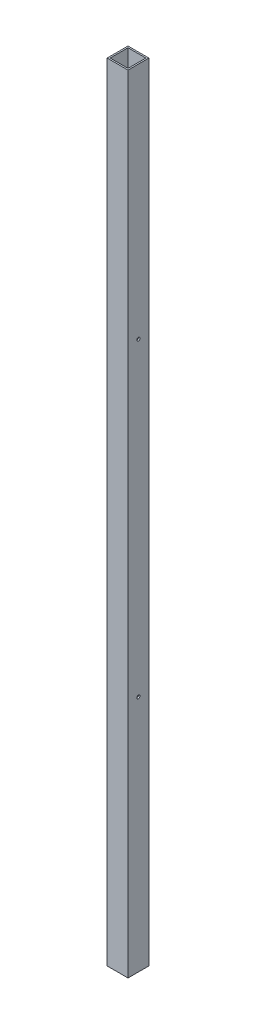
ISO-10303-21;
HEADER;
FILE_DESCRIPTION(('STEP AP214'),'2;1');
FILE_NAME('part.step','',(''),(''),'','','');
FILE_SCHEMA(('AUTOMOTIVE_DESIGN { 1 0 10303 214 1 1 1 1 }'));
ENDSEC;
DATA;
#1=APPLICATION_CONTEXT('core data for automotive mechanical design processes');
#2=APPLICATION_PROTOCOL_DEFINITION('international standard','automotive_design',2000,#1);
#3=PRODUCT_CONTEXT('',#1,'mechanical');
#4=PRODUCT('Part','Part','',(#3));
#5=PRODUCT_RELATED_PRODUCT_CATEGORY('part','',(#4));
#6=PRODUCT_DEFINITION_FORMATION('','',#4);
#7=PRODUCT_DEFINITION_CONTEXT('part definition',#1,'design');
#8=PRODUCT_DEFINITION('design','',#6,#7);
#9=PRODUCT_DEFINITION_SHAPE('','',#8);
#10=(LENGTH_UNIT() NAMED_UNIT(*) SI_UNIT(.MILLI.,.METRE.));
#11=(NAMED_UNIT(*) PLANE_ANGLE_UNIT() SI_UNIT($,.RADIAN.));
#12=(NAMED_UNIT(*) SI_UNIT($,.STERADIAN.) SOLID_ANGLE_UNIT());
#13=UNCERTAINTY_MEASURE_WITH_UNIT(LENGTH_MEASURE(1.E-05),#10,'distance_accuracy_value','');
#14=(GEOMETRIC_REPRESENTATION_CONTEXT(3) GLOBAL_UNCERTAINTY_ASSIGNED_CONTEXT((#13)) GLOBAL_UNIT_ASSIGNED_CONTEXT((#10,
#11,#12)) REPRESENTATION_CONTEXT('',''));
#15=CARTESIAN_POINT('',(0.,0.,0.));
#16=DIRECTION('',(0.,0.,1.));
#17=DIRECTION('',(1.,0.,0.));
#18=AXIS2_PLACEMENT_3D('',#15,#16,#17);
#19=CARTESIAN_POINT('',(1479.08154032126,-1168.4,22.225));
#20=DIRECTION('',(1.,0.,0.));
#21=DIRECTION('',(0.,0.,-1.));
#22=AXIS2_PLACEMENT_3D('',#19,#20,#21);
#23=CYLINDRICAL_SURFACE('',#22,3.3782);
#24=CARTESIAN_POINT('',(-155.061557817459,-1168.4,22.225));
#25=DIRECTION('',(1.,0.,0.));
#26=DIRECTION('',(0.,0.,-1.));
#27=AXIS2_PLACEMENT_3D('',#24,#25,#26);
#28=CIRCLE('',#27,3.3782);
#29=CARTESIAN_POINT('',(-155.061557817459,-1168.4,18.8468));
#30=VERTEX_POINT('',#29);
#31=EDGE_CURVE('E126',#30,#30,#28,.T.);
#32=ORIENTED_EDGE('',*,*,#31,.T.);
#33=EDGE_LOOP('',(#32));
#34=FACE_BOUND('',#33,.T.);
#35=CARTESIAN_POINT('',(-158.236557817459,-1168.4,22.225));
#36=DIRECTION('',(1.,0.,0.));
#37=DIRECTION('',(0.,0.,-1.));
#38=AXIS2_PLACEMENT_3D('',#35,#36,#37);
#39=CIRCLE('',#38,3.3782);
#40=CARTESIAN_POINT('',(-158.236557817459,-1168.4,18.8468));
#41=VERTEX_POINT('',#40);
#42=EDGE_CURVE('E17',#41,#41,#39,.T.);
#43=ORIENTED_EDGE('',*,*,#42,.F.);
#44=EDGE_LOOP('',(#43));
#45=FACE_BOUND('',#44,.T.);
#46=ADVANCED_FACE('F14',(#34,#45),#23,.F.);
#47=CARTESIAN_POINT('',(1479.08154032126,-508.,22.225));
#48=DIRECTION('',(1.,0.,0.));
#49=DIRECTION('',(0.,0.,-1.));
#50=AXIS2_PLACEMENT_3D('',#47,#48,#49);
#51=CYLINDRICAL_SURFACE('',#50,3.3782);
#52=CARTESIAN_POINT('',(-155.061557817459,-508.,22.225));
#53=DIRECTION('',(1.,0.,0.));
#54=DIRECTION('',(0.,0.,-1.));
#55=AXIS2_PLACEMENT_3D('',#52,#53,#54);
#56=CIRCLE('',#55,3.3782);
#57=CARTESIAN_POINT('',(-155.061557817459,-508.,18.8468));
#58=VERTEX_POINT('',#57);
#59=EDGE_CURVE('E122',#58,#58,#56,.T.);
#60=ORIENTED_EDGE('',*,*,#59,.T.);
#61=EDGE_LOOP('',(#60));
#62=FACE_BOUND('',#61,.T.);
#63=CARTESIAN_POINT('',(-158.236557817459,-508.,22.225));
#64=DIRECTION('',(1.,0.,0.));
#65=DIRECTION('',(0.,0.,-1.));
#66=AXIS2_PLACEMENT_3D('',#63,#64,#65);
#67=CIRCLE('',#66,3.3782);
#68=CARTESIAN_POINT('',(-158.236557817459,-508.,18.8468));
#69=VERTEX_POINT('',#68);
#70=EDGE_CURVE('E113',#69,#69,#67,.T.);
#71=ORIENTED_EDGE('',*,*,#70,.F.);
#72=EDGE_LOOP('',(#71));
#73=FACE_BOUND('',#72,.T.);
#74=ADVANCED_FACE('F140',(#62,#73),#51,.F.);
#75=CARTESIAN_POINT('',(-177.286557817459,-1676.4,41.275));
#76=DIRECTION('',(0.,0.,-1.));
#77=DIRECTION('',(-1.,0.,0.));
#78=AXIS2_PLACEMENT_3D('',#75,#76,#77);
#79=PLANE('',#78);
#80=DIRECTION('',(1.,0.,0.));
#81=VECTOR('',#80,1.);
#82=CARTESIAN_POINT('',(-177.286557817459,-1676.4,41.275));
#83=LINE('',#82,#81);
#84=CARTESIAN_POINT('',(-196.336557817459,-1676.4,41.275));
#85=VERTEX_POINT('',#84);
#86=CARTESIAN_POINT('',(-158.236557817459,-1676.4,41.275));
#87=VERTEX_POINT('',#86);
#88=EDGE_CURVE('E195',#85,#87,#83,.T.);
#89=ORIENTED_EDGE('',*,*,#88,.F.);
#90=DIRECTION('',(0.,1.,0.));
#91=VECTOR('',#90,1.);
#92=CARTESIAN_POINT('',(-196.336557817459,-1676.4,41.275));
#93=LINE('',#92,#91);
#94=CARTESIAN_POINT('',(-196.336557817459,0.,41.275));
#95=VERTEX_POINT('',#94);
#96=EDGE_CURVE('E108',#85,#95,#93,.T.);
#97=ORIENTED_EDGE('',*,*,#96,.T.);
#98=DIRECTION('',(1.,0.,0.));
#99=VECTOR('',#98,1.);
#100=CARTESIAN_POINT('',(-177.286557817459,0.,41.275));
#101=LINE('',#100,#99);
#102=CARTESIAN_POINT('',(-158.236557817459,0.,41.275));
#103=VERTEX_POINT('',#102);
#104=EDGE_CURVE('E104',#95,#103,#101,.T.);
#105=ORIENTED_EDGE('',*,*,#104,.T.);
#106=DIRECTION('',(0.,1.,0.));
#107=VECTOR('',#106,1.);
#108=CARTESIAN_POINT('',(-158.236557817459,-1676.4,41.275));
#109=LINE('',#108,#107);
#110=EDGE_CURVE('E76',#87,#103,#109,.T.);
#111=ORIENTED_EDGE('',*,*,#110,.F.);
#112=EDGE_LOOP('',(#89,#97,#105,#111));
#113=FACE_BOUND('',#112,.T.);
#114=ADVANCED_FACE('F146',(#113),#79,.T.);
#115=CARTESIAN_POINT('',(-158.236557817459,-1676.4,22.225));
#116=DIRECTION('',(-1.,0.,0.));
#117=DIRECTION('',(0.,0.,1.));
#118=AXIS2_PLACEMENT_3D('',#115,#116,#117);
#119=PLANE('',#118);
#120=DIRECTION('',(0.,0.,-1.));
#121=VECTOR('',#120,1.);
#122=CARTESIAN_POINT('',(-158.236557817459,-1676.4,22.225));
#123=LINE('',#122,#121);
#124=CARTESIAN_POINT('',(-158.236557817459,-1676.4,3.175));
#125=VERTEX_POINT('',#124);
#126=EDGE_CURVE('E199',#87,#125,#123,.T.);
#127=ORIENTED_EDGE('',*,*,#126,.F.);
#128=ORIENTED_EDGE('',*,*,#110,.T.);
#129=DIRECTION('',(0.,0.,-1.));
#130=VECTOR('',#129,1.);
#131=CARTESIAN_POINT('',(-158.236557817459,0.,22.225));
#132=LINE('',#131,#130);
#133=CARTESIAN_POINT('',(-158.236557817459,0.,3.175));
#134=VERTEX_POINT('',#133);
#135=EDGE_CURVE('E79',#103,#134,#132,.T.);
#136=ORIENTED_EDGE('',*,*,#135,.T.);
#137=DIRECTION('',(0.,1.,0.));
#138=VECTOR('',#137,1.);
#139=CARTESIAN_POINT('',(-158.236557817459,-1676.4,3.175));
#140=LINE('',#139,#138);
#141=EDGE_CURVE('E83',#134,#125,#140,.F.);
#142=ORIENTED_EDGE('',*,*,#141,.T.);
#143=EDGE_LOOP('',(#127,#128,#136,#142));
#144=FACE_BOUND('',#143,.T.);
#145=ORIENTED_EDGE('',*,*,#70,.T.);
#146=EDGE_LOOP('',(#145));
#147=FACE_BOUND('',#146,.T.);
#148=ORIENTED_EDGE('',*,*,#42,.T.);
#149=EDGE_LOOP('',(#148));
#150=FACE_BOUND('',#149,.T.);
#151=ADVANCED_FACE('F81',(#144,#147,#150),#119,.T.);
#152=CARTESIAN_POINT('',(-177.286557817459,-1676.4,3.175));
#153=DIRECTION('',(0.,0.,-1.));
#154=DIRECTION('',(-1.,0.,0.));
#155=AXIS2_PLACEMENT_3D('',#152,#153,#154);
#156=PLANE('',#155);
#157=DIRECTION('',(0.,1.,0.));
#158=VECTOR('',#157,1.);
#159=CARTESIAN_POINT('',(-196.336557817459,-1676.4,3.175));
#160=LINE('',#159,#158);
#161=CARTESIAN_POINT('',(-196.336557817459,0.,3.175));
#162=VERTEX_POINT('',#161);
#163=CARTESIAN_POINT('',(-196.336557817459,-1676.4,3.175));
#164=VERTEX_POINT('',#163);
#165=EDGE_CURVE('E97',#162,#164,#160,.F.);
#166=ORIENTED_EDGE('',*,*,#165,.T.);
#167=DIRECTION('',(1.,0.,0.));
#168=VECTOR('',#167,1.);
#169=CARTESIAN_POINT('',(-177.286557817459,-1676.4,3.175));
#170=LINE('',#169,#168);
#171=EDGE_CURVE('E95',#125,#164,#170,.F.);
#172=ORIENTED_EDGE('',*,*,#171,.F.);
#173=ORIENTED_EDGE('',*,*,#141,.F.);
#174=DIRECTION('',(1.,0.,0.));
#175=VECTOR('',#174,1.);
#176=CARTESIAN_POINT('',(-177.286557817459,0.,3.175));
#177=LINE('',#176,#175);
#178=EDGE_CURVE('E88',#134,#162,#177,.F.);
#179=ORIENTED_EDGE('',*,*,#178,.T.);
#180=EDGE_LOOP('',(#166,#172,#173,#179));
#181=FACE_BOUND('',#180,.T.);
#182=ADVANCED_FACE('F92',(#181),#156,.F.);
#183=CARTESIAN_POINT('',(-196.336557817459,-1676.4,22.225));
#184=DIRECTION('',(-1.,0.,0.));
#185=DIRECTION('',(0.,0.,1.));
#186=AXIS2_PLACEMENT_3D('',#183,#184,#185);
#187=PLANE('',#186);
#188=ORIENTED_EDGE('',*,*,#96,.F.);
#189=DIRECTION('',(0.,0.,-1.));
#190=VECTOR('',#189,1.);
#191=CARTESIAN_POINT('',(-196.336557817459,-1676.4,22.225));
#192=LINE('',#191,#190);
#193=EDGE_CURVE('E204',#164,#85,#192,.F.);
#194=ORIENTED_EDGE('',*,*,#193,.F.);
#195=ORIENTED_EDGE('',*,*,#165,.F.);
#196=DIRECTION('',(0.,0.,-1.));
#197=VECTOR('',#196,1.);
#198=CARTESIAN_POINT('',(-196.336557817459,0.,22.225));
#199=LINE('',#198,#197);
#200=EDGE_CURVE('E102',#162,#95,#199,.F.);
#201=ORIENTED_EDGE('',*,*,#200,.T.);
#202=EDGE_LOOP('',(#188,#194,#195,#201));
#203=FACE_BOUND('',#202,.T.);
#204=CARTESIAN_POINT('',(-196.336557817459,-508.,22.225));
#205=DIRECTION('',(1.,0.,0.));
#206=DIRECTION('',(0.,0.,-1.));
#207=AXIS2_PLACEMENT_3D('',#204,#205,#206);
#208=CIRCLE('',#207,3.3782);
#209=CARTESIAN_POINT('',(-196.336557817459,-508.,18.8468));
#210=VERTEX_POINT('',#209);
#211=EDGE_CURVE('E89',#210,#210,#208,.F.);
#212=ORIENTED_EDGE('',*,*,#211,.T.);
#213=EDGE_LOOP('',(#212));
#214=FACE_BOUND('',#213,.T.);
#215=CARTESIAN_POINT('',(-196.336557817459,-1168.4,22.225));
#216=DIRECTION('',(1.,0.,0.));
#217=DIRECTION('',(0.,0.,-1.));
#218=AXIS2_PLACEMENT_3D('',#215,#216,#217);
#219=CIRCLE('',#218,3.3782);
#220=CARTESIAN_POINT('',(-196.336557817459,-1168.4,18.8468));
#221=VERTEX_POINT('',#220);
#222=EDGE_CURVE('E110',#221,#221,#219,.F.);
#223=ORIENTED_EDGE('',*,*,#222,.T.);
#224=EDGE_LOOP('',(#223));
#225=FACE_BOUND('',#224,.T.);
#226=ADVANCED_FACE('F181',(#203,#214,#225),#187,.F.);
#227=CARTESIAN_POINT('',(1479.08154032126,-1168.4,22.225));
#228=DIRECTION('',(1.,0.,0.));
#229=DIRECTION('',(0.,0.,-1.));
#230=AXIS2_PLACEMENT_3D('',#227,#228,#229);
#231=CYLINDRICAL_SURFACE('',#230,3.3782);
#232=ORIENTED_EDGE('',*,*,#222,.F.);
#233=EDGE_LOOP('',(#232));
#234=FACE_BOUND('',#233,.T.);
#235=CARTESIAN_POINT('',(-199.511557817459,-1168.4,22.225));
#236=DIRECTION('',(1.,0.,0.));
#237=DIRECTION('',(0.,0.,-1.));
#238=AXIS2_PLACEMENT_3D('',#235,#236,#237);
#239=CIRCLE('',#238,3.3782);
#240=CARTESIAN_POINT('',(-199.511557817459,-1168.4,18.8468));
#241=VERTEX_POINT('',#240);
#242=EDGE_CURVE('E118',#241,#241,#239,.T.);
#243=ORIENTED_EDGE('',*,*,#242,.F.);
#244=EDGE_LOOP('',(#243));
#245=FACE_BOUND('',#244,.T.);
#246=ADVANCED_FACE('F177',(#234,#245),#231,.F.);
#247=CARTESIAN_POINT('',(1479.08154032126,-508.,22.225));
#248=DIRECTION('',(1.,0.,0.));
#249=DIRECTION('',(0.,0.,-1.));
#250=AXIS2_PLACEMENT_3D('',#247,#248,#249);
#251=CYLINDRICAL_SURFACE('',#250,3.3782);
#252=ORIENTED_EDGE('',*,*,#211,.F.);
#253=EDGE_LOOP('',(#252));
#254=FACE_BOUND('',#253,.T.);
#255=CARTESIAN_POINT('',(-199.511557817459,-508.,22.225));
#256=DIRECTION('',(1.,0.,0.));
#257=DIRECTION('',(0.,0.,-1.));
#258=AXIS2_PLACEMENT_3D('',#255,#256,#257);
#259=CIRCLE('',#258,3.3782);
#260=CARTESIAN_POINT('',(-199.511557817459,-508.,18.8468));
#261=VERTEX_POINT('',#260);
#262=EDGE_CURVE('E114',#261,#261,#259,.T.);
#263=ORIENTED_EDGE('',*,*,#262,.F.);
#264=EDGE_LOOP('',(#263));
#265=FACE_BOUND('',#264,.T.);
#266=ADVANCED_FACE('F173',(#254,#265),#251,.F.);
#267=CARTESIAN_POINT('',(-177.286557817459,-1676.4,44.45));
#268=DIRECTION('',(0.,0.,-1.));
#269=DIRECTION('',(-1.,0.,0.));
#270=AXIS2_PLACEMENT_3D('',#267,#268,#269);
#271=PLANE('',#270);
#272=DIRECTION('',(0.,1.,0.));
#273=VECTOR('',#272,1.);
#274=CARTESIAN_POINT('',(-199.511557817459,-1676.4,44.45));
#275=LINE('',#274,#273);
#276=CARTESIAN_POINT('',(-199.511557817459,-1676.4,44.45));
#277=VERTEX_POINT('',#276);
#278=CARTESIAN_POINT('',(-199.511557817459,0.,44.45));
#279=VERTEX_POINT('',#278);
#280=EDGE_CURVE('E220',#277,#279,#275,.T.);
#281=ORIENTED_EDGE('',*,*,#280,.F.);
#282=DIRECTION('',(1.,0.,0.));
#283=VECTOR('',#282,1.);
#284=CARTESIAN_POINT('',(-177.286557817459,-1676.4,44.45));
#285=LINE('',#284,#283);
#286=CARTESIAN_POINT('',(-155.061557817459,-1676.4,44.45));
#287=VERTEX_POINT('',#286);
#288=EDGE_CURVE('E121',#287,#277,#285,.F.);
#289=ORIENTED_EDGE('',*,*,#288,.F.);
#290=DIRECTION('',(0.,1.,0.));
#291=VECTOR('',#290,1.);
#292=CARTESIAN_POINT('',(-155.061557817459,-1676.4,44.45));
#293=LINE('',#292,#291);
#294=CARTESIAN_POINT('',(-155.061557817459,0.,44.45));
#295=VERTEX_POINT('',#294);
#296=EDGE_CURVE('E125',#287,#295,#293,.T.);
#297=ORIENTED_EDGE('',*,*,#296,.T.);
#298=DIRECTION('',(1.,0.,0.));
#299=VECTOR('',#298,1.);
#300=CARTESIAN_POINT('',(-177.286557817459,0.,44.45));
#301=LINE('',#300,#299);
#302=EDGE_CURVE('E129',#295,#279,#301,.F.);
#303=ORIENTED_EDGE('',*,*,#302,.T.);
#304=EDGE_LOOP('',(#281,#289,#297,#303));
#305=FACE_BOUND('',#304,.T.);
#306=ADVANCED_FACE('F169',(#305),#271,.F.);
#307=CARTESIAN_POINT('',(-177.286557817459,0.,22.225));
#308=DIRECTION('',(0.,-1.,0.));
#309=DIRECTION('',(0.,0.,-1.));
#310=AXIS2_PLACEMENT_3D('',#307,#308,#309);
#311=PLANE('',#310);
#312=DIRECTION('',(0.,0.,1.));
#313=VECTOR('',#312,1.);
#314=CARTESIAN_POINT('',(-199.511557817459,0.,22.225));
#315=LINE('',#314,#313);
#316=CARTESIAN_POINT('',(-199.511557817459,0.,0.));
#317=VERTEX_POINT('',#316);
#318=EDGE_CURVE('E117',#279,#317,#315,.F.);
#319=ORIENTED_EDGE('',*,*,#318,.F.);
#320=ORIENTED_EDGE('',*,*,#302,.F.);
#321=DIRECTION('',(0.,0.,1.));
#322=VECTOR('',#321,1.);
#323=CARTESIAN_POINT('',(-155.061557817459,0.,22.225));
#324=LINE('',#323,#322);
#325=CARTESIAN_POINT('',(-155.061557817459,0.,0.));
#326=VERTEX_POINT('',#325);
#327=EDGE_CURVE('E200',#295,#326,#324,.F.);
#328=ORIENTED_EDGE('',*,*,#327,.T.);
#329=DIRECTION('',(-1.,0.,0.));
#330=VECTOR('',#329,1.);
#331=CARTESIAN_POINT('',(-177.286557817459,0.,0.));
#332=LINE('',#331,#330);
#333=EDGE_CURVE('E224',#317,#326,#332,.F.);
#334=ORIENTED_EDGE('',*,*,#333,.F.);
#335=EDGE_LOOP('',(#319,#320,#328,#334));
#336=FACE_BOUND('',#335,.T.);
#337=ORIENTED_EDGE('',*,*,#200,.F.);
#338=ORIENTED_EDGE('',*,*,#178,.F.);
#339=ORIENTED_EDGE('',*,*,#135,.F.);
#340=ORIENTED_EDGE('',*,*,#104,.F.);
#341=EDGE_LOOP('',(#337,#338,#339,#340));
#342=FACE_BOUND('',#341,.T.);
#343=ADVANCED_FACE('F100',(#336,#342),#311,.F.);
#344=CARTESIAN_POINT('',(-155.061557817459,-1676.4,22.225));
#345=DIRECTION('',(-1.,0.,0.));
#346=DIRECTION('',(0.,0.,1.));
#347=AXIS2_PLACEMENT_3D('',#344,#345,#346);
#348=PLANE('',#347);
#349=ORIENTED_EDGE('',*,*,#296,.F.);
#350=DIRECTION('',(0.,0.,-1.));
#351=VECTOR('',#350,1.);
#352=CARTESIAN_POINT('',(-155.061557817459,-1676.4,22.225));
#353=LINE('',#352,#351);
#354=CARTESIAN_POINT('',(-155.061557817459,-1676.4,0.));
#355=VERTEX_POINT('',#354);
#356=EDGE_CURVE('E205',#355,#287,#353,.F.);
#357=ORIENTED_EDGE('',*,*,#356,.F.);
#358=DIRECTION('',(0.,1.,0.));
#359=VECTOR('',#358,1.);
#360=CARTESIAN_POINT('',(-155.061557817459,-1676.4,0.));
#361=LINE('',#360,#359);
#362=EDGE_CURVE('E228',#326,#355,#361,.F.);
#363=ORIENTED_EDGE('',*,*,#362,.F.);
#364=ORIENTED_EDGE('',*,*,#327,.F.);
#365=EDGE_LOOP('',(#349,#357,#363,#364));
#366=FACE_BOUND('',#365,.T.);
#367=ORIENTED_EDGE('',*,*,#59,.F.);
#368=EDGE_LOOP('',(#367));
#369=FACE_BOUND('',#368,.T.);
#370=ORIENTED_EDGE('',*,*,#31,.F.);
#371=EDGE_LOOP('',(#370));
#372=FACE_BOUND('',#371,.T.);
#373=ADVANCED_FACE('F163',(#366,#369,#372),#348,.F.);
#374=CARTESIAN_POINT('',(-177.286557817459,-1676.4,22.225));
#375=DIRECTION('',(0.,-1.,0.));
#376=DIRECTION('',(0.,0.,-1.));
#377=AXIS2_PLACEMENT_3D('',#374,#375,#376);
#378=PLANE('',#377);
#379=ORIENTED_EDGE('',*,*,#288,.T.);
#380=DIRECTION('',(0.,0.,1.));
#381=VECTOR('',#380,1.);
#382=CARTESIAN_POINT('',(-199.511557817459,-1676.4,22.225));
#383=LINE('',#382,#381);
#384=CARTESIAN_POINT('',(-199.511557817459,-1676.4,0.));
#385=VERTEX_POINT('',#384);
#386=EDGE_CURVE('E32',#385,#277,#383,.T.);
#387=ORIENTED_EDGE('',*,*,#386,.F.);
#388=DIRECTION('',(-1.,0.,0.));
#389=VECTOR('',#388,1.);
#390=CARTESIAN_POINT('',(-177.286557817459,-1676.4,0.));
#391=LINE('',#390,#389);
#392=EDGE_CURVE('E23',#355,#385,#391,.T.);
#393=ORIENTED_EDGE('',*,*,#392,.F.);
#394=ORIENTED_EDGE('',*,*,#356,.T.);
#395=EDGE_LOOP('',(#379,#387,#393,#394));
#396=FACE_BOUND('',#395,.T.);
#397=ORIENTED_EDGE('',*,*,#171,.T.);
#398=ORIENTED_EDGE('',*,*,#193,.T.);
#399=ORIENTED_EDGE('',*,*,#88,.T.);
#400=ORIENTED_EDGE('',*,*,#126,.T.);
#401=EDGE_LOOP('',(#397,#398,#399,#400));
#402=FACE_BOUND('',#401,.T.);
#403=ADVANCED_FACE('F156',(#396,#402),#378,.T.);
#404=CARTESIAN_POINT('',(-199.511557817459,-1676.4,22.225));
#405=DIRECTION('',(-1.,0.,0.));
#406=DIRECTION('',(0.,0.,1.));
#407=AXIS2_PLACEMENT_3D('',#404,#405,#406);
#408=PLANE('',#407);
#409=ORIENTED_EDGE('',*,*,#386,.T.);
#410=ORIENTED_EDGE('',*,*,#280,.T.);
#411=ORIENTED_EDGE('',*,*,#318,.T.);
#412=DIRECTION('',(0.,1.,0.));
#413=VECTOR('',#412,1.);
#414=CARTESIAN_POINT('',(-199.511557817459,-1676.4,0.));
#415=LINE('',#414,#413);
#416=EDGE_CURVE('E9',#385,#317,#415,.T.);
#417=ORIENTED_EDGE('',*,*,#416,.F.);
#418=EDGE_LOOP('',(#409,#410,#411,#417));
#419=FACE_BOUND('',#418,.T.);
#420=ORIENTED_EDGE('',*,*,#262,.T.);
#421=EDGE_LOOP('',(#420));
#422=FACE_BOUND('',#421,.T.);
#423=ORIENTED_EDGE('',*,*,#242,.T.);
#424=EDGE_LOOP('',(#423));
#425=FACE_BOUND('',#424,.T.);
#426=ADVANCED_FACE('F150',(#419,#422,#425),#408,.T.);
#427=CARTESIAN_POINT('',(-177.286557817459,-1676.4,0.));
#428=DIRECTION('',(0.,0.,-1.));
#429=DIRECTION('',(-1.,0.,0.));
#430=AXIS2_PLACEMENT_3D('',#427,#428,#429);
#431=PLANE('',#430);
#432=ORIENTED_EDGE('',*,*,#392,.T.);
#433=ORIENTED_EDGE('',*,*,#416,.T.);
#434=ORIENTED_EDGE('',*,*,#333,.T.);
#435=ORIENTED_EDGE('',*,*,#362,.T.);
#436=EDGE_LOOP('',(#432,#433,#434,#435));
#437=FACE_BOUND('',#436,.T.);
#438=ADVANCED_FACE('F148',(#437),#431,.T.);
#439=CLOSED_SHELL('',(#46,#74,#114,#151,#182,#226,#246,#266,#306,#343,#373,#403,#426,#438));
#440=MANIFOLD_SOLID_BREP('B1',#439);
#441=ADVANCED_BREP_SHAPE_REPRESENTATION('',(#18,#440),#14);
#442=SHAPE_DEFINITION_REPRESENTATION(#9,#441);
ENDSEC;
END-ISO-10303-21;
